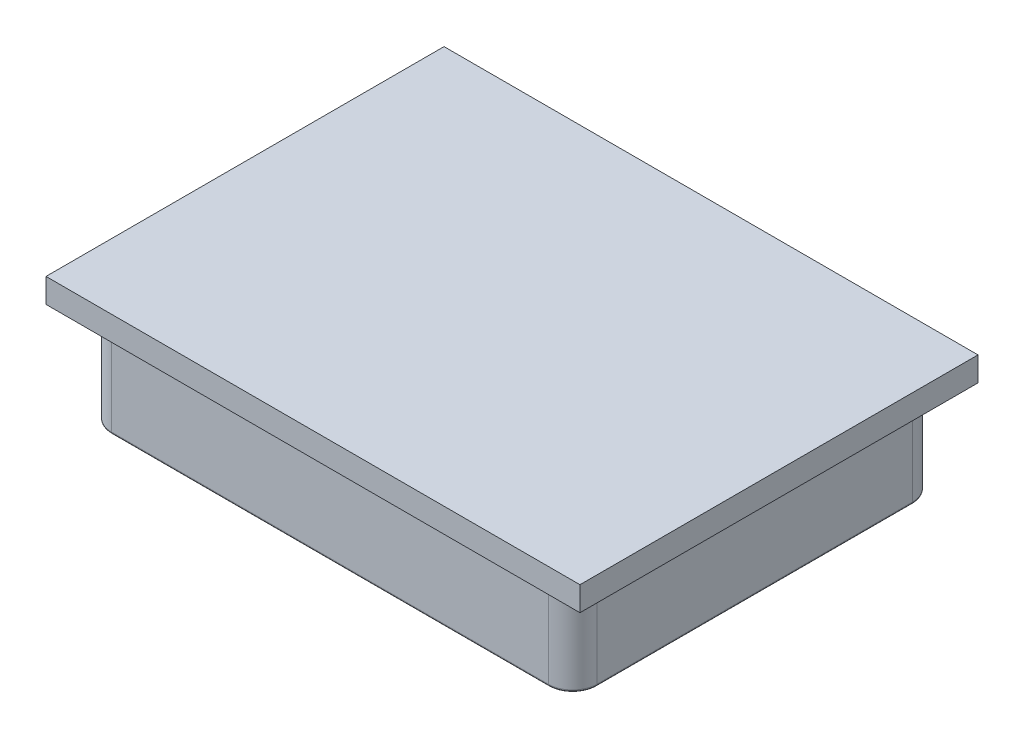
ISO-10303-21;
HEADER;
FILE_DESCRIPTION(('STEP AP214'),'2;1');
FILE_NAME('part.step','',(''),(''),'','','');
FILE_SCHEMA(('AUTOMOTIVE_DESIGN { 1 0 10303 214 1 1 1 1 }'));
ENDSEC;
DATA;
#1=APPLICATION_CONTEXT('core data for automotive mechanical design processes');
#2=APPLICATION_PROTOCOL_DEFINITION('international standard','automotive_design',2000,#1);
#3=PRODUCT_CONTEXT('',#1,'mechanical');
#4=PRODUCT('Part','Part','',(#3));
#5=PRODUCT_RELATED_PRODUCT_CATEGORY('part','',(#4));
#6=PRODUCT_DEFINITION_FORMATION('','',#4);
#7=PRODUCT_DEFINITION_CONTEXT('part definition',#1,'design');
#8=PRODUCT_DEFINITION('design','',#6,#7);
#9=PRODUCT_DEFINITION_SHAPE('','',#8);
#10=(LENGTH_UNIT() NAMED_UNIT(*) SI_UNIT(.MILLI.,.METRE.));
#11=(NAMED_UNIT(*) PLANE_ANGLE_UNIT() SI_UNIT($,.RADIAN.));
#12=(NAMED_UNIT(*) SI_UNIT($,.STERADIAN.) SOLID_ANGLE_UNIT());
#13=UNCERTAINTY_MEASURE_WITH_UNIT(LENGTH_MEASURE(1.E-05),#10,'distance_accuracy_value','');
#14=(GEOMETRIC_REPRESENTATION_CONTEXT(3) GLOBAL_UNCERTAINTY_ASSIGNED_CONTEXT((#13)) GLOBAL_UNIT_ASSIGNED_CONTEXT((#10,
#11,#12)) REPRESENTATION_CONTEXT('',''));
#15=CARTESIAN_POINT('',(0.,0.,0.));
#16=DIRECTION('',(0.,0.,1.));
#17=DIRECTION('',(1.,0.,0.));
#18=AXIS2_PLACEMENT_3D('',#15,#16,#17);
#19=CARTESIAN_POINT('',(0.,25.,0.));
#20=DIRECTION('',(0.,-1.,0.));
#21=DIRECTION('',(0.,0.,-1.));
#22=AXIS2_PLACEMENT_3D('',#19,#20,#21);
#23=PLANE('',#22);
#24=DIRECTION('',(0.,0.,-1.));
#25=VECTOR('',#24,1.);
#26=CARTESIAN_POINT('',(-55.,25.,-41.));
#27=LINE('',#26,#25);
#28=CARTESIAN_POINT('',(-55.,25.,41.));
#29=VERTEX_POINT('',#28);
#30=CARTESIAN_POINT('',(-55.,25.,-41.));
#31=VERTEX_POINT('',#30);
#32=EDGE_CURVE('E318',#29,#31,#27,.T.);
#33=ORIENTED_EDGE('',*,*,#32,.F.);
#34=DIRECTION('',(-1.,0.,0.));
#35=VECTOR('',#34,1.);
#36=CARTESIAN_POINT('',(55.,25.,41.));
#37=LINE('',#36,#35);
#38=CARTESIAN_POINT('',(55.,25.,41.));
#39=VERTEX_POINT('',#38);
#40=EDGE_CURVE('E327',#39,#29,#37,.T.);
#41=ORIENTED_EDGE('',*,*,#40,.F.);
#42=DIRECTION('',(0.,0.,1.));
#43=VECTOR('',#42,1.);
#44=CARTESIAN_POINT('',(55.,25.,-41.));
#45=LINE('',#44,#43);
#46=CARTESIAN_POINT('',(55.,25.,-41.));
#47=VERTEX_POINT('',#46);
#48=EDGE_CURVE('E324',#47,#39,#45,.T.);
#49=ORIENTED_EDGE('',*,*,#48,.F.);
#50=DIRECTION('',(1.,0.,0.));
#51=VECTOR('',#50,1.);
#52=CARTESIAN_POINT('',(55.,25.,-41.));
#53=LINE('',#52,#51);
#54=EDGE_CURVE('E321',#31,#47,#53,.T.);
#55=ORIENTED_EDGE('',*,*,#54,.F.);
#56=EDGE_LOOP('',(#33,#41,#49,#55));
#57=FACE_BOUND('',#56,.T.);
#58=ADVANCED_FACE('F48',(#57),#23,.F.);
#59=CARTESIAN_POINT('',(55.,25.,-41.));
#60=DIRECTION('',(0.,0.,-1.));
#61=DIRECTION('',(-1.,0.,0.));
#62=AXIS2_PLACEMENT_3D('',#59,#60,#61);
#63=PLANE('',#62);
#64=DIRECTION('',(0.,-1.,0.));
#65=VECTOR('',#64,1.);
#66=CARTESIAN_POINT('',(55.,25.,-41.));
#67=LINE('',#66,#65);
#68=CARTESIAN_POINT('',(55.,20.,-41.));
#69=VERTEX_POINT('',#68);
#70=EDGE_CURVE('E337',#47,#69,#67,.T.);
#71=ORIENTED_EDGE('',*,*,#70,.T.);
#72=DIRECTION('',(-1.,0.,0.));
#73=VECTOR('',#72,1.);
#74=CARTESIAN_POINT('',(55.,20.,-41.));
#75=LINE('',#74,#73);
#76=CARTESIAN_POINT('',(-55.,20.,-41.));
#77=VERTEX_POINT('',#76);
#78=EDGE_CURVE('E52',#69,#77,#75,.T.);
#79=ORIENTED_EDGE('',*,*,#78,.T.);
#80=DIRECTION('',(0.,-1.,0.));
#81=VECTOR('',#80,1.);
#82=CARTESIAN_POINT('',(-55.,25.,-41.));
#83=LINE('',#82,#81);
#84=EDGE_CURVE('E330',#31,#77,#83,.T.);
#85=ORIENTED_EDGE('',*,*,#84,.F.);
#86=ORIENTED_EDGE('',*,*,#54,.T.);
#87=EDGE_LOOP('',(#71,#79,#85,#86));
#88=FACE_BOUND('',#87,.T.);
#89=ADVANCED_FACE('F352',(#88),#63,.T.);
#90=CARTESIAN_POINT('',(55.,25.,-41.));
#91=DIRECTION('',(1.,0.,0.));
#92=DIRECTION('',(0.,0.,-1.));
#93=AXIS2_PLACEMENT_3D('',#90,#91,#92);
#94=PLANE('',#93);
#95=DIRECTION('',(0.,-1.,0.));
#96=VECTOR('',#95,1.);
#97=CARTESIAN_POINT('',(55.,25.,41.));
#98=LINE('',#97,#96);
#99=CARTESIAN_POINT('',(55.,20.,41.));
#100=VERTEX_POINT('',#99);
#101=EDGE_CURVE('E334',#39,#100,#98,.T.);
#102=ORIENTED_EDGE('',*,*,#101,.T.);
#103=DIRECTION('',(0.,0.,-1.));
#104=VECTOR('',#103,1.);
#105=CARTESIAN_POINT('',(55.,20.,-41.));
#106=LINE('',#105,#104);
#107=EDGE_CURVE('E230',#100,#69,#106,.T.);
#108=ORIENTED_EDGE('',*,*,#107,.T.);
#109=ORIENTED_EDGE('',*,*,#70,.F.);
#110=ORIENTED_EDGE('',*,*,#48,.T.);
#111=EDGE_LOOP('',(#102,#108,#109,#110));
#112=FACE_BOUND('',#111,.T.);
#113=ADVANCED_FACE('F358',(#112),#94,.T.);
#114=CARTESIAN_POINT('',(55.,25.,41.));
#115=DIRECTION('',(0.,0.,1.));
#116=DIRECTION('',(1.,0.,0.));
#117=AXIS2_PLACEMENT_3D('',#114,#115,#116);
#118=PLANE('',#117);
#119=DIRECTION('',(0.,-1.,0.));
#120=VECTOR('',#119,1.);
#121=CARTESIAN_POINT('',(-55.,25.,41.));
#122=LINE('',#121,#120);
#123=CARTESIAN_POINT('',(-55.,20.,41.));
#124=VERTEX_POINT('',#123);
#125=EDGE_CURVE('E331',#29,#124,#122,.T.);
#126=ORIENTED_EDGE('',*,*,#125,.T.);
#127=DIRECTION('',(1.,0.,0.));
#128=VECTOR('',#127,1.);
#129=CARTESIAN_POINT('',(55.,20.,41.));
#130=LINE('',#129,#128);
#131=EDGE_CURVE('E312',#124,#100,#130,.T.);
#132=ORIENTED_EDGE('',*,*,#131,.T.);
#133=ORIENTED_EDGE('',*,*,#101,.F.);
#134=ORIENTED_EDGE('',*,*,#40,.T.);
#135=EDGE_LOOP('',(#126,#132,#133,#134));
#136=FACE_BOUND('',#135,.T.);
#137=ADVANCED_FACE('F365',(#136),#118,.T.);
#138=CARTESIAN_POINT('',(-55.,25.,-41.));
#139=DIRECTION('',(-1.,0.,0.));
#140=DIRECTION('',(0.,0.,1.));
#141=AXIS2_PLACEMENT_3D('',#138,#139,#140);
#142=PLANE('',#141);
#143=ORIENTED_EDGE('',*,*,#84,.T.);
#144=DIRECTION('',(0.,0.,1.));
#145=VECTOR('',#144,1.);
#146=CARTESIAN_POINT('',(-55.,20.,-41.));
#147=LINE('',#146,#145);
#148=EDGE_CURVE('E315',#77,#124,#147,.T.);
#149=ORIENTED_EDGE('',*,*,#148,.T.);
#150=ORIENTED_EDGE('',*,*,#125,.F.);
#151=ORIENTED_EDGE('',*,*,#32,.T.);
#152=EDGE_LOOP('',(#143,#149,#150,#151));
#153=FACE_BOUND('',#152,.T.);
#154=ADVANCED_FACE('F50',(#153),#142,.T.);
#155=CARTESIAN_POINT('',(-50.,0.5,37.));
#156=DIRECTION('',(-1.,0.,0.));
#157=DIRECTION('',(0.,0.,1.));
#158=AXIS2_PLACEMENT_3D('',#155,#156,#157);
#159=CYLINDRICAL_SURFACE('',#158,0.5);
#160=CARTESIAN_POINT('',(-45.,0.5,37.));
#161=DIRECTION('',(1.,0.,0.));
#162=DIRECTION('',(0.,0.,-1.));
#163=AXIS2_PLACEMENT_3D('',#160,#161,#162);
#164=CIRCLE('',#163,0.5);
#165=CARTESIAN_POINT('',(-45.,0.5,37.5));
#166=VERTEX_POINT('',#165);
#167=CARTESIAN_POINT('',(-45.,0.,37.));
#168=VERTEX_POINT('',#167);
#169=EDGE_CURVE('E223',#166,#168,#164,.T.);
#170=ORIENTED_EDGE('',*,*,#169,.T.);
#171=DIRECTION('',(1.,0.,0.));
#172=VECTOR('',#171,1.);
#173=CARTESIAN_POINT('',(-45.,0.,37.));
#174=LINE('',#173,#172);
#175=CARTESIAN_POINT('',(45.,0.,37.));
#176=VERTEX_POINT('',#175);
#177=EDGE_CURVE('E250',#176,#168,#174,.F.);
#178=ORIENTED_EDGE('',*,*,#177,.F.);
#179=CARTESIAN_POINT('',(45.,0.5,37.));
#180=DIRECTION('',(1.,0.,0.));
#181=DIRECTION('',(0.,0.,-1.));
#182=AXIS2_PLACEMENT_3D('',#179,#180,#181);
#183=CIRCLE('',#182,0.5);
#184=CARTESIAN_POINT('',(45.,0.5,37.5));
#185=VERTEX_POINT('',#184);
#186=EDGE_CURVE('E222',#185,#176,#183,.T.);
#187=ORIENTED_EDGE('',*,*,#186,.F.);
#188=DIRECTION('',(1.,0.,0.));
#189=VECTOR('',#188,1.);
#190=CARTESIAN_POINT('',(45.,0.5,37.5));
#191=LINE('',#190,#189);
#192=EDGE_CURVE('E219',#166,#185,#191,.T.);
#193=ORIENTED_EDGE('',*,*,#192,.F.);
#194=EDGE_LOOP('',(#170,#178,#187,#193));
#195=FACE_BOUND('',#194,.T.);
#196=ADVANCED_FACE('F404',(#195),#159,.T.);
#197=CARTESIAN_POINT('',(45.,0.5,32.5));
#198=DIRECTION('',(0.,-1.,0.));
#199=DIRECTION('',(0.,0.,-1.));
#200=AXIS2_PLACEMENT_3D('',#197,#198,#199);
#201=TOROIDAL_SURFACE('',#200,4.5,0.5);
#202=CARTESIAN_POINT('',(49.5,0.5,32.5));
#203=DIRECTION('',(0.,0.,1.));
#204=DIRECTION('',(1.,0.,0.));
#205=AXIS2_PLACEMENT_3D('',#202,#203,#204);
#206=CIRCLE('',#205,0.5);
#207=CARTESIAN_POINT('',(49.5,0.,32.5));
#208=VERTEX_POINT('',#207);
#209=CARTESIAN_POINT('',(50.,0.5,32.5));
#210=VERTEX_POINT('',#209);
#211=EDGE_CURVE('E253',#208,#210,#206,.T.);
#212=ORIENTED_EDGE('',*,*,#211,.T.);
#213=CARTESIAN_POINT('',(45.,0.5,32.5));
#214=DIRECTION('',(0.,-1.,0.));
#215=DIRECTION('',(0.,0.,-1.));
#216=AXIS2_PLACEMENT_3D('',#213,#214,#215);
#217=CIRCLE('',#216,5.);
#218=EDGE_CURVE('E212',#185,#210,#217,.F.);
#219=ORIENTED_EDGE('',*,*,#218,.F.);
#220=ORIENTED_EDGE('',*,*,#186,.T.);
#221=CARTESIAN_POINT('',(45.,0.,32.5));
#222=DIRECTION('',(0.,-1.,0.));
#223=DIRECTION('',(0.,0.,-1.));
#224=AXIS2_PLACEMENT_3D('',#221,#222,#223);
#225=CIRCLE('',#224,4.5);
#226=EDGE_CURVE('E216',#208,#176,#225,.T.);
#227=ORIENTED_EDGE('',*,*,#226,.F.);
#228=EDGE_LOOP('',(#212,#219,#220,#227));
#229=FACE_BOUND('',#228,.T.);
#230=ADVANCED_FACE('F390',(#229),#201,.T.);
#231=CARTESIAN_POINT('',(-50.,0.5,-37.));
#232=DIRECTION('',(1.,0.,0.));
#233=DIRECTION('',(0.,0.,-1.));
#234=AXIS2_PLACEMENT_3D('',#231,#232,#233);
#235=CYLINDRICAL_SURFACE('',#234,0.5);
#236=CARTESIAN_POINT('',(-45.,0.5,-37.));
#237=DIRECTION('',(1.,0.,0.));
#238=DIRECTION('',(0.,0.,-1.));
#239=AXIS2_PLACEMENT_3D('',#236,#237,#238);
#240=CIRCLE('',#239,0.5);
#241=CARTESIAN_POINT('',(-45.,0.,-37.));
#242=VERTEX_POINT('',#241);
#243=CARTESIAN_POINT('',(-45.,0.5,-37.5));
#244=VERTEX_POINT('',#243);
#245=EDGE_CURVE('E215',#242,#244,#240,.T.);
#246=ORIENTED_EDGE('',*,*,#245,.T.);
#247=DIRECTION('',(-1.,0.,0.));
#248=VECTOR('',#247,1.);
#249=CARTESIAN_POINT('',(-45.,0.5,-37.5));
#250=LINE('',#249,#248);
#251=CARTESIAN_POINT('',(45.,0.5,-37.5));
#252=VERTEX_POINT('',#251);
#253=EDGE_CURVE('E187',#252,#244,#250,.T.);
#254=ORIENTED_EDGE('',*,*,#253,.F.);
#255=CARTESIAN_POINT('',(45.,0.5,-37.));
#256=DIRECTION('',(1.,0.,0.));
#257=DIRECTION('',(0.,0.,-1.));
#258=AXIS2_PLACEMENT_3D('',#255,#256,#257);
#259=CIRCLE('',#258,0.5);
#260=CARTESIAN_POINT('',(45.,0.,-37.));
#261=VERTEX_POINT('',#260);
#262=EDGE_CURVE('E191',#261,#252,#259,.T.);
#263=ORIENTED_EDGE('',*,*,#262,.F.);
#264=DIRECTION('',(-1.,0.,0.));
#265=VECTOR('',#264,1.);
#266=CARTESIAN_POINT('',(45.,0.,-37.));
#267=LINE('',#266,#265);
#268=EDGE_CURVE('E243',#242,#261,#267,.F.);
#269=ORIENTED_EDGE('',*,*,#268,.F.);
#270=EDGE_LOOP('',(#246,#254,#263,#269));
#271=FACE_BOUND('',#270,.T.);
#272=ADVANCED_FACE('F420',(#271),#235,.T.);
#273=CARTESIAN_POINT('',(45.,0.5,-32.5));
#274=DIRECTION('',(0.,-1.,0.));
#275=DIRECTION('',(0.,0.,-1.));
#276=AXIS2_PLACEMENT_3D('',#273,#274,#275);
#277=TOROIDAL_SURFACE('',#276,4.5,0.5);
#278=ORIENTED_EDGE('',*,*,#262,.T.);
#279=CARTESIAN_POINT('',(45.,0.5,-32.5));
#280=DIRECTION('',(0.,-1.,0.));
#281=DIRECTION('',(0.,0.,-1.));
#282=AXIS2_PLACEMENT_3D('',#279,#280,#281);
#283=CIRCLE('',#282,5.);
#284=CARTESIAN_POINT('',(50.,0.5,-32.5));
#285=VERTEX_POINT('',#284);
#286=EDGE_CURVE('E196',#285,#252,#283,.F.);
#287=ORIENTED_EDGE('',*,*,#286,.F.);
#288=CARTESIAN_POINT('',(49.5,0.5,-32.5));
#289=DIRECTION('',(0.,0.,1.));
#290=DIRECTION('',(1.,0.,0.));
#291=AXIS2_PLACEMENT_3D('',#288,#289,#290);
#292=CIRCLE('',#291,0.5);
#293=CARTESIAN_POINT('',(49.5,0.,-32.5));
#294=VERTEX_POINT('',#293);
#295=EDGE_CURVE('E200',#294,#285,#292,.T.);
#296=ORIENTED_EDGE('',*,*,#295,.F.);
#297=CARTESIAN_POINT('',(45.,0.,-32.5));
#298=DIRECTION('',(0.,-1.,0.));
#299=DIRECTION('',(0.,0.,-1.));
#300=AXIS2_PLACEMENT_3D('',#297,#298,#299);
#301=CIRCLE('',#300,4.5);
#302=EDGE_CURVE('E190',#261,#294,#301,.T.);
#303=ORIENTED_EDGE('',*,*,#302,.F.);
#304=EDGE_LOOP('',(#278,#287,#296,#303));
#305=FACE_BOUND('',#304,.T.);
#306=ADVANCED_FACE('F423',(#305),#277,.T.);
#307=CARTESIAN_POINT('',(49.5,0.5,37.5));
#308=DIRECTION('',(0.,0.,1.));
#309=DIRECTION('',(1.,0.,0.));
#310=AXIS2_PLACEMENT_3D('',#307,#308,#309);
#311=CYLINDRICAL_SURFACE('',#310,0.5);
#312=ORIENTED_EDGE('',*,*,#295,.T.);
#313=DIRECTION('',(0.,0.,-1.));
#314=VECTOR('',#313,1.);
#315=CARTESIAN_POINT('',(50.,0.5,-32.5));
#316=LINE('',#315,#314);
#317=EDGE_CURVE('E204',#210,#285,#316,.T.);
#318=ORIENTED_EDGE('',*,*,#317,.F.);
#319=ORIENTED_EDGE('',*,*,#211,.F.);
#320=DIRECTION('',(0.,0.,-1.));
#321=VECTOR('',#320,1.);
#322=CARTESIAN_POINT('',(49.5,0.,32.5));
#323=LINE('',#322,#321);
#324=EDGE_CURVE('E199',#294,#208,#323,.F.);
#325=ORIENTED_EDGE('',*,*,#324,.F.);
#326=EDGE_LOOP('',(#312,#318,#319,#325));
#327=FACE_BOUND('',#326,.T.);
#328=ADVANCED_FACE('F394',(#327),#311,.T.);
#329=CARTESIAN_POINT('',(0.,0.,0.));
#330=DIRECTION('',(0.,-1.,0.));
#331=DIRECTION('',(0.,0.,-1.));
#332=AXIS2_PLACEMENT_3D('',#329,#330,#331);
#333=PLANE('',#332);
#334=ORIENTED_EDGE('',*,*,#324,.T.);
#335=ORIENTED_EDGE('',*,*,#226,.T.);
#336=ORIENTED_EDGE('',*,*,#177,.T.);
#337=CARTESIAN_POINT('',(-45.,0.,32.5));
#338=DIRECTION('',(0.,-1.,0.));
#339=DIRECTION('',(0.,0.,-1.));
#340=AXIS2_PLACEMENT_3D('',#337,#338,#339);
#341=CIRCLE('',#340,4.5);
#342=CARTESIAN_POINT('',(-49.5,0.,32.5));
#343=VERTEX_POINT('',#342);
#344=EDGE_CURVE('E231',#168,#343,#341,.T.);
#345=ORIENTED_EDGE('',*,*,#344,.T.);
#346=DIRECTION('',(0.,0.,1.));
#347=VECTOR('',#346,1.);
#348=CARTESIAN_POINT('',(-49.5,0.,-32.5));
#349=LINE('',#348,#347);
#350=CARTESIAN_POINT('',(-49.5,0.,-32.5));
#351=VERTEX_POINT('',#350);
#352=EDGE_CURVE('E234',#343,#351,#349,.F.);
#353=ORIENTED_EDGE('',*,*,#352,.T.);
#354=CARTESIAN_POINT('',(-45.,0.,-32.5));
#355=DIRECTION('',(0.,-1.,0.));
#356=DIRECTION('',(0.,0.,-1.));
#357=AXIS2_PLACEMENT_3D('',#354,#355,#356);
#358=CIRCLE('',#357,4.5);
#359=EDGE_CURVE('E207',#351,#242,#358,.T.);
#360=ORIENTED_EDGE('',*,*,#359,.T.);
#361=ORIENTED_EDGE('',*,*,#268,.T.);
#362=ORIENTED_EDGE('',*,*,#302,.T.);
#363=EDGE_LOOP('',(#334,#335,#336,#345,#353,#360,#361,#362));
#364=FACE_BOUND('',#363,.T.);
#365=ADVANCED_FACE('F385',(#364),#333,.T.);
#366=CARTESIAN_POINT('',(-45.,0.5,-32.5));
#367=DIRECTION('',(0.,-1.,0.));
#368=DIRECTION('',(0.,0.,-1.));
#369=AXIS2_PLACEMENT_3D('',#366,#367,#368);
#370=TOROIDAL_SURFACE('',#369,4.5,0.5);
#371=CARTESIAN_POINT('',(-49.5,0.5,-32.5));
#372=DIRECTION('',(0.,0.,1.));
#373=DIRECTION('',(1.,0.,0.));
#374=AXIS2_PLACEMENT_3D('',#371,#372,#373);
#375=CIRCLE('',#374,0.5);
#376=CARTESIAN_POINT('',(-50.,0.5,-32.5));
#377=VERTEX_POINT('',#376);
#378=EDGE_CURVE('E183',#377,#351,#375,.T.);
#379=ORIENTED_EDGE('',*,*,#378,.F.);
#380=CARTESIAN_POINT('',(-45.,0.5,-32.5));
#381=DIRECTION('',(0.,-1.,0.));
#382=DIRECTION('',(0.,0.,-1.));
#383=AXIS2_PLACEMENT_3D('',#380,#381,#382);
#384=CIRCLE('',#383,5.);
#385=EDGE_CURVE('E169',#244,#377,#384,.F.);
#386=ORIENTED_EDGE('',*,*,#385,.F.);
#387=ORIENTED_EDGE('',*,*,#245,.F.);
#388=ORIENTED_EDGE('',*,*,#359,.F.);
#389=EDGE_LOOP('',(#379,#386,#387,#388));
#390=FACE_BOUND('',#389,.T.);
#391=ADVANCED_FACE('F414',(#390),#370,.T.);
#392=CARTESIAN_POINT('',(-49.5,0.5,37.5));
#393=DIRECTION('',(0.,0.,-1.));
#394=DIRECTION('',(-1.,0.,0.));
#395=AXIS2_PLACEMENT_3D('',#392,#393,#394);
#396=CYLINDRICAL_SURFACE('',#395,0.5);
#397=ORIENTED_EDGE('',*,*,#378,.T.);
#398=ORIENTED_EDGE('',*,*,#352,.F.);
#399=CARTESIAN_POINT('',(-49.5,0.5,32.5));
#400=DIRECTION('',(0.,0.,1.));
#401=DIRECTION('',(1.,0.,0.));
#402=AXIS2_PLACEMENT_3D('',#399,#400,#401);
#403=CIRCLE('',#402,0.5);
#404=CARTESIAN_POINT('',(-50.,0.5,32.5));
#405=VERTEX_POINT('',#404);
#406=EDGE_CURVE('E180',#405,#343,#403,.T.);
#407=ORIENTED_EDGE('',*,*,#406,.F.);
#408=DIRECTION('',(0.,0.,1.));
#409=VECTOR('',#408,1.);
#410=CARTESIAN_POINT('',(-50.,0.5,32.5));
#411=LINE('',#410,#409);
#412=EDGE_CURVE('E178',#377,#405,#411,.T.);
#413=ORIENTED_EDGE('',*,*,#412,.F.);
#414=EDGE_LOOP('',(#397,#398,#407,#413));
#415=FACE_BOUND('',#414,.T.);
#416=ADVANCED_FACE('F412',(#415),#396,.T.);
#417=CARTESIAN_POINT('',(-45.,0.5,32.5));
#418=DIRECTION('',(0.,-1.,0.));
#419=DIRECTION('',(0.,0.,-1.));
#420=AXIS2_PLACEMENT_3D('',#417,#418,#419);
#421=TOROIDAL_SURFACE('',#420,4.5,0.5);
#422=ORIENTED_EDGE('',*,*,#406,.T.);
#423=ORIENTED_EDGE('',*,*,#344,.F.);
#424=ORIENTED_EDGE('',*,*,#169,.F.);
#425=CARTESIAN_POINT('',(-45.,0.5,32.5));
#426=DIRECTION('',(0.,-1.,0.));
#427=DIRECTION('',(0.,0.,-1.));
#428=AXIS2_PLACEMENT_3D('',#425,#426,#427);
#429=CIRCLE('',#428,5.);
#430=EDGE_CURVE('E177',#405,#166,#429,.F.);
#431=ORIENTED_EDGE('',*,*,#430,.F.);
#432=EDGE_LOOP('',(#422,#423,#424,#431));
#433=FACE_BOUND('',#432,.T.);
#434=ADVANCED_FACE('F438',(#433),#421,.T.);
#435=CARTESIAN_POINT('',(-45.,20.,32.5));
#436=DIRECTION('',(0.,-1.,0.));
#437=DIRECTION('',(0.,0.,-1.));
#438=AXIS2_PLACEMENT_3D('',#435,#436,#437);
#439=CYLINDRICAL_SURFACE('',#438,5.);
#440=DIRECTION('',(0.,-1.,0.));
#441=VECTOR('',#440,1.);
#442=CARTESIAN_POINT('',(-50.,20.,32.5));
#443=LINE('',#442,#441);
#444=CARTESIAN_POINT('',(-50.,20.,32.5));
#445=VERTEX_POINT('',#444);
#446=EDGE_CURVE('E155',#405,#445,#443,.F.);
#447=ORIENTED_EDGE('',*,*,#446,.F.);
#448=ORIENTED_EDGE('',*,*,#430,.T.);
#449=DIRECTION('',(0.,-1.,0.));
#450=VECTOR('',#449,1.);
#451=CARTESIAN_POINT('',(-45.,20.,37.5));
#452=LINE('',#451,#450);
#453=CARTESIAN_POINT('',(-45.,20.,37.5));
#454=VERTEX_POINT('',#453);
#455=EDGE_CURVE('E217',#454,#166,#452,.T.);
#456=ORIENTED_EDGE('',*,*,#455,.F.);
#457=CARTESIAN_POINT('',(-45.,20.,32.5));
#458=DIRECTION('',(0.,-1.,0.));
#459=DIRECTION('',(0.,0.,-1.));
#460=AXIS2_PLACEMENT_3D('',#457,#458,#459);
#461=CIRCLE('',#460,5.);
#462=EDGE_CURVE('E174',#445,#454,#461,.F.);
#463=ORIENTED_EDGE('',*,*,#462,.F.);
#464=EDGE_LOOP('',(#447,#448,#456,#463));
#465=FACE_BOUND('',#464,.T.);
#466=ADVANCED_FACE('F436',(#465),#439,.T.);
#467=CARTESIAN_POINT('',(-50.,20.,37.5));
#468=DIRECTION('',(0.,0.,-1.));
#469=DIRECTION('',(-1.,0.,0.));
#470=AXIS2_PLACEMENT_3D('',#467,#468,#469);
#471=PLANE('',#470);
#472=ORIENTED_EDGE('',*,*,#455,.T.);
#473=ORIENTED_EDGE('',*,*,#192,.T.);
#474=DIRECTION('',(0.,-1.,0.));
#475=VECTOR('',#474,1.);
#476=CARTESIAN_POINT('',(45.,20.,37.5));
#477=LINE('',#476,#475);
#478=CARTESIAN_POINT('',(45.,20.,37.5));
#479=VERTEX_POINT('',#478);
#480=EDGE_CURVE('E208',#185,#479,#477,.F.);
#481=ORIENTED_EDGE('',*,*,#480,.T.);
#482=DIRECTION('',(1.,0.,0.));
#483=VECTOR('',#482,1.);
#484=CARTESIAN_POINT('',(-50.,20.,37.5));
#485=LINE('',#484,#483);
#486=EDGE_CURVE('E211',#454,#479,#485,.T.);
#487=ORIENTED_EDGE('',*,*,#486,.F.);
#488=EDGE_LOOP('',(#472,#473,#481,#487));
#489=FACE_BOUND('',#488,.T.);
#490=ADVANCED_FACE('F401',(#489),#471,.F.);
#491=CARTESIAN_POINT('',(45.,20.,32.5));
#492=DIRECTION('',(0.,-1.,0.));
#493=DIRECTION('',(0.,0.,-1.));
#494=AXIS2_PLACEMENT_3D('',#491,#492,#493);
#495=CYLINDRICAL_SURFACE('',#494,5.);
#496=ORIENTED_EDGE('',*,*,#480,.F.);
#497=ORIENTED_EDGE('',*,*,#218,.T.);
#498=DIRECTION('',(0.,-1.,0.));
#499=VECTOR('',#498,1.);
#500=CARTESIAN_POINT('',(50.,20.,32.5));
#501=LINE('',#500,#499);
#502=CARTESIAN_POINT('',(50.,20.,32.5));
#503=VERTEX_POINT('',#502);
#504=EDGE_CURVE('E201',#503,#210,#501,.T.);
#505=ORIENTED_EDGE('',*,*,#504,.F.);
#506=CARTESIAN_POINT('',(45.,20.,32.5));
#507=DIRECTION('',(0.,-1.,0.));
#508=DIRECTION('',(0.,0.,-1.));
#509=AXIS2_PLACEMENT_3D('',#506,#507,#508);
#510=CIRCLE('',#509,5.);
#511=EDGE_CURVE('E203',#479,#503,#510,.F.);
#512=ORIENTED_EDGE('',*,*,#511,.F.);
#513=EDGE_LOOP('',(#496,#497,#505,#512));
#514=FACE_BOUND('',#513,.T.);
#515=ADVANCED_FACE('F398',(#514),#495,.T.);
#516=CARTESIAN_POINT('',(50.,20.,37.5));
#517=DIRECTION('',(-1.,0.,0.));
#518=DIRECTION('',(0.,0.,1.));
#519=AXIS2_PLACEMENT_3D('',#516,#517,#518);
#520=PLANE('',#519);
#521=ORIENTED_EDGE('',*,*,#504,.T.);
#522=ORIENTED_EDGE('',*,*,#317,.T.);
#523=DIRECTION('',(0.,-1.,0.));
#524=VECTOR('',#523,1.);
#525=CARTESIAN_POINT('',(50.,20.,-32.5));
#526=LINE('',#525,#524);
#527=CARTESIAN_POINT('',(50.,20.,-32.5));
#528=VERTEX_POINT('',#527);
#529=EDGE_CURVE('E192',#285,#528,#526,.F.);
#530=ORIENTED_EDGE('',*,*,#529,.T.);
#531=DIRECTION('',(0.,0.,-1.));
#532=VECTOR('',#531,1.);
#533=CARTESIAN_POINT('',(50.,20.,37.5));
#534=LINE('',#533,#532);
#535=EDGE_CURVE('E195',#503,#528,#534,.T.);
#536=ORIENTED_EDGE('',*,*,#535,.F.);
#537=EDGE_LOOP('',(#521,#522,#530,#536));
#538=FACE_BOUND('',#537,.T.);
#539=ADVANCED_FACE('F428',(#538),#520,.F.);
#540=CARTESIAN_POINT('',(45.,20.,-32.5));
#541=DIRECTION('',(0.,-1.,0.));
#542=DIRECTION('',(0.,0.,-1.));
#543=AXIS2_PLACEMENT_3D('',#540,#541,#542);
#544=CYLINDRICAL_SURFACE('',#543,5.);
#545=ORIENTED_EDGE('',*,*,#529,.F.);
#546=ORIENTED_EDGE('',*,*,#286,.T.);
#547=DIRECTION('',(0.,-1.,0.));
#548=VECTOR('',#547,1.);
#549=CARTESIAN_POINT('',(45.,20.,-37.5));
#550=LINE('',#549,#548);
#551=CARTESIAN_POINT('',(45.,20.,-37.5));
#552=VERTEX_POINT('',#551);
#553=EDGE_CURVE('E184',#552,#252,#550,.T.);
#554=ORIENTED_EDGE('',*,*,#553,.F.);
#555=CARTESIAN_POINT('',(45.,20.,-32.5));
#556=DIRECTION('',(0.,-1.,0.));
#557=DIRECTION('',(0.,0.,-1.));
#558=AXIS2_PLACEMENT_3D('',#555,#556,#557);
#559=CIRCLE('',#558,5.);
#560=EDGE_CURVE('E186',#528,#552,#559,.F.);
#561=ORIENTED_EDGE('',*,*,#560,.F.);
#562=EDGE_LOOP('',(#545,#546,#554,#561));
#563=FACE_BOUND('',#562,.T.);
#564=ADVANCED_FACE('F426',(#563),#544,.T.);
#565=CARTESIAN_POINT('',(-50.,20.,-37.5));
#566=DIRECTION('',(0.,0.,1.));
#567=DIRECTION('',(1.,0.,0.));
#568=AXIS2_PLACEMENT_3D('',#565,#566,#567);
#569=PLANE('',#568);
#570=ORIENTED_EDGE('',*,*,#553,.T.);
#571=ORIENTED_EDGE('',*,*,#253,.T.);
#572=DIRECTION('',(0.,-1.,0.));
#573=VECTOR('',#572,1.);
#574=CARTESIAN_POINT('',(-45.,20.,-37.5));
#575=LINE('',#574,#573);
#576=CARTESIAN_POINT('',(-45.,20.,-37.5));
#577=VERTEX_POINT('',#576);
#578=EDGE_CURVE('E164',#244,#577,#575,.F.);
#579=ORIENTED_EDGE('',*,*,#578,.T.);
#580=DIRECTION('',(-1.,0.,0.));
#581=VECTOR('',#580,1.);
#582=CARTESIAN_POINT('',(-50.,20.,-37.5));
#583=LINE('',#582,#581);
#584=EDGE_CURVE('E162',#552,#577,#583,.T.);
#585=ORIENTED_EDGE('',*,*,#584,.F.);
#586=EDGE_LOOP('',(#570,#571,#579,#585));
#587=FACE_BOUND('',#586,.T.);
#588=ADVANCED_FACE('F579',(#587),#569,.F.);
#589=CARTESIAN_POINT('',(-45.,20.,-32.5));
#590=DIRECTION('',(0.,-1.,0.));
#591=DIRECTION('',(0.,0.,-1.));
#592=AXIS2_PLACEMENT_3D('',#589,#590,#591);
#593=CYLINDRICAL_SURFACE('',#592,5.);
#594=ORIENTED_EDGE('',*,*,#578,.F.);
#595=ORIENTED_EDGE('',*,*,#385,.T.);
#596=DIRECTION('',(0.,-1.,0.));
#597=VECTOR('',#596,1.);
#598=CARTESIAN_POINT('',(-50.,20.,-32.5));
#599=LINE('',#598,#597);
#600=CARTESIAN_POINT('',(-50.,20.,-32.5));
#601=VERTEX_POINT('',#600);
#602=EDGE_CURVE('E152',#601,#377,#599,.T.);
#603=ORIENTED_EDGE('',*,*,#602,.F.);
#604=CARTESIAN_POINT('',(-45.,20.,-32.5));
#605=DIRECTION('',(0.,-1.,0.));
#606=DIRECTION('',(0.,0.,-1.));
#607=AXIS2_PLACEMENT_3D('',#604,#605,#606);
#608=CIRCLE('',#607,5.);
#609=EDGE_CURVE('E143',#577,#601,#608,.F.);
#610=ORIENTED_EDGE('',*,*,#609,.F.);
#611=EDGE_LOOP('',(#594,#595,#603,#610));
#612=FACE_BOUND('',#611,.T.);
#613=ADVANCED_FACE('F167',(#612),#593,.T.);
#614=CARTESIAN_POINT('',(-50.,20.,37.5));
#615=DIRECTION('',(1.,0.,0.));
#616=DIRECTION('',(0.,0.,-1.));
#617=AXIS2_PLACEMENT_3D('',#614,#615,#616);
#618=PLANE('',#617);
#619=ORIENTED_EDGE('',*,*,#602,.T.);
#620=ORIENTED_EDGE('',*,*,#412,.T.);
#621=ORIENTED_EDGE('',*,*,#446,.T.);
#622=DIRECTION('',(0.,0.,1.));
#623=VECTOR('',#622,1.);
#624=CARTESIAN_POINT('',(-50.,20.,37.5));
#625=LINE('',#624,#623);
#626=EDGE_CURVE('E149',#601,#445,#625,.T.);
#627=ORIENTED_EDGE('',*,*,#626,.F.);
#628=EDGE_LOOP('',(#619,#620,#621,#627));
#629=FACE_BOUND('',#628,.T.);
#630=ADVANCED_FACE('F150',(#629),#618,.F.);
#631=CARTESIAN_POINT('',(0.,20.,0.));
#632=DIRECTION('',(0.,-1.,0.));
#633=DIRECTION('',(0.,0.,-1.));
#634=AXIS2_PLACEMENT_3D('',#631,#632,#633);
#635=PLANE('',#634);
#636=ORIENTED_EDGE('',*,*,#626,.T.);
#637=ORIENTED_EDGE('',*,*,#462,.T.);
#638=ORIENTED_EDGE('',*,*,#486,.T.);
#639=ORIENTED_EDGE('',*,*,#511,.T.);
#640=ORIENTED_EDGE('',*,*,#535,.T.);
#641=ORIENTED_EDGE('',*,*,#560,.T.);
#642=ORIENTED_EDGE('',*,*,#584,.T.);
#643=ORIENTED_EDGE('',*,*,#609,.T.);
#644=EDGE_LOOP('',(#636,#637,#638,#639,#640,#641,#642,#643));
#645=FACE_BOUND('',#644,.T.);
#646=DIRECTION('',(0.,0.,1.));
#647=VECTOR('',#646,1.);
#648=CARTESIAN_POINT('',(-52.,20.,0.));
#649=LINE('',#648,#647);
#650=CARTESIAN_POINT('',(-52.,20.,-32.5));
#651=VERTEX_POINT('',#650);
#652=CARTESIAN_POINT('',(-52.,20.,32.5));
#653=VERTEX_POINT('',#652);
#654=EDGE_CURVE('E68',#651,#653,#649,.T.);
#655=ORIENTED_EDGE('',*,*,#654,.F.);
#656=CARTESIAN_POINT('',(-45.,20.,-39.5));
#657=CARTESIAN_POINT('',(-45.6891810343366,20.,-39.5));
#658=CARTESIAN_POINT('',(-46.3656322541129,20.,-39.3654969628226));
#659=CARTESIAN_POINT('',(-47.0413319485692,20.,-39.2311433561364));
#660=CARTESIAN_POINT('',(-47.6787840265556,20.,-38.967156727579));
#661=CARTESIAN_POINT('',(-48.3152892524453,20.,-38.7035622168001));
#662=CARTESIAN_POINT('',(-48.8889916311372,20.,-38.3202872861178));
#663=CARTESIAN_POINT('',(-49.4618418495963,20.,-37.937581660473));
#664=CARTESIAN_POINT('',(-49.9497474683058,20.,-37.4497474683058));
#665=CARTESIAN_POINT('',(-50.4369283667048,20.,-36.9626378903545));
#666=CARTESIAN_POINT('',(-50.8202872861178,20.,-36.3889916311372));
#667=CARTESIAN_POINT('',(-51.2030767757374,20.,-35.8161974487971));
#668=CARTESIAN_POINT('',(-51.467156727579,20.,-35.1787840265556));
#669=CARTESIAN_POINT('',(-51.7308444230134,20.,-34.5423173990148));
#670=CARTESIAN_POINT('',(-51.8654969628226,20.,-33.8656322541129));
#671=CARTESIAN_POINT('',(-52.,20.,-33.189698422259));
#672=CARTESIAN_POINT('',(-52.,20.,-32.5));
#673=B_SPLINE_CURVE_WITH_KNOTS('',2,(#656,#657,#658,#659,#660,#661,#662,#663,#664,#665,#666,
#667,#668,#669,#670,#671,#672),.UNSPECIFIED.,.F.,.F.,(3,2,2,2,2,2,2,2,3),(0.,0.125,0.25,0.375,
0.5,0.625,0.75,0.875,1.),.UNSPECIFIED.);
#674=CARTESIAN_POINT('',(-45.,20.,-39.5));
#675=VERTEX_POINT('',#674);
#676=EDGE_CURVE('E13',#675,#651,#673,.T.);
#677=ORIENTED_EDGE('',*,*,#676,.F.);
#678=DIRECTION('',(-1.,0.,0.));
#679=VECTOR('',#678,1.);
#680=CARTESIAN_POINT('',(0.,20.,-39.5));
#681=LINE('',#680,#679);
#682=CARTESIAN_POINT('',(45.,20.,-39.5));
#683=VERTEX_POINT('',#682);
#684=EDGE_CURVE('E59',#683,#675,#681,.T.);
#685=ORIENTED_EDGE('',*,*,#684,.F.);
#686=CARTESIAN_POINT('',(52.,20.,-32.5));
#687=CARTESIAN_POINT('',(52.,20.,-33.1891810343179));
#688=CARTESIAN_POINT('',(51.8654969628226,20.,-33.8656322541129));
#689=CARTESIAN_POINT('',(51.7311433561482,20.,-34.5413319485288));
#690=CARTESIAN_POINT('',(51.467156727579,20.,-35.1787840265556));
#691=CARTESIAN_POINT('',(51.2035622168184,20.,-35.8152892524133));
#692=CARTESIAN_POINT('',(50.8202872861178,20.,-36.3889916311372));
#693=CARTESIAN_POINT('',(50.4375816604824,20.,-36.9618418495868));
#694=CARTESIAN_POINT('',(49.9497474683058,20.,-37.4497474683058));
#695=CARTESIAN_POINT('',(49.4626378903544,20.,-37.9369283667049));
#696=CARTESIAN_POINT('',(48.8889916311372,20.,-38.3202872861178));
#697=CARTESIAN_POINT('',(48.3161974487926,20.,-38.7030767757404));
#698=CARTESIAN_POINT('',(47.6787840265556,20.,-38.967156727579));
#699=CARTESIAN_POINT('',(47.0423173990139,20.,-39.2308444230126));
#700=CARTESIAN_POINT('',(46.3656322541129,20.,-39.3654969628226));
#701=CARTESIAN_POINT('',(45.6896984222638,20.,-39.5));
#702=CARTESIAN_POINT('',(45.,20.,-39.5));
#703=B_SPLINE_CURVE_WITH_KNOTS('',2,(#686,#687,#688,#689,#690,#691,#692,#693,#694,#695,#696,
#697,#698,#699,#700,#701,#702),.UNSPECIFIED.,.F.,.F.,(3,2,2,2,2,2,2,2,3),(0.,0.125,0.25,0.375,
0.5,0.625,0.75,0.875,1.),.UNSPECIFIED.);
#704=CARTESIAN_POINT('',(52.,20.,-32.5));
#705=VERTEX_POINT('',#704);
#706=EDGE_CURVE('E282',#705,#683,#703,.T.);
#707=ORIENTED_EDGE('',*,*,#706,.F.);
#708=DIRECTION('',(0.,0.,-1.));
#709=VECTOR('',#708,1.);
#710=CARTESIAN_POINT('',(52.,20.,0.));
#711=LINE('',#710,#709);
#712=CARTESIAN_POINT('',(52.,20.,32.5));
#713=VERTEX_POINT('',#712);
#714=EDGE_CURVE('E291',#713,#705,#711,.T.);
#715=ORIENTED_EDGE('',*,*,#714,.F.);
#716=CARTESIAN_POINT('',(45.,20.,39.5));
#717=CARTESIAN_POINT('',(45.6891810343414,20.,39.5));
#718=CARTESIAN_POINT('',(46.3656322541129,20.,39.3654969628226));
#719=CARTESIAN_POINT('',(47.0413319485721,20.,39.2311433561349));
#720=CARTESIAN_POINT('',(47.6787840265556,20.,38.967156727579));
#721=CARTESIAN_POINT('',(48.3152892524623,20.,38.7035622167934));
#722=CARTESIAN_POINT('',(48.8889916311372,20.,38.3202872861178));
#723=CARTESIAN_POINT('',(49.4618418496103,20.,37.9375816604589));
#724=CARTESIAN_POINT('',(49.9497474683058,20.,37.4497474683058));
#725=CARTESIAN_POINT('',(50.4369283667143,20.,36.962637890345));
#726=CARTESIAN_POINT('',(50.8202872861178,20.,36.3889916311372));
#727=CARTESIAN_POINT('',(51.2030767757506,20.,35.8161974487727));
#728=CARTESIAN_POINT('',(51.467156727579,20.,35.1787840265556));
#729=CARTESIAN_POINT('',(51.7308444230162,20.,34.5423173990006));
#730=CARTESIAN_POINT('',(51.8654969628226,20.,33.8656322541129));
#731=CARTESIAN_POINT('',(52.,20.,33.1896984222591));
#732=CARTESIAN_POINT('',(52.,20.,32.5));
#733=B_SPLINE_CURVE_WITH_KNOTS('',2,(#716,#717,#718,#719,#720,#721,#722,#723,#724,#725,#726,
#727,#728,#729,#730,#731,#732),.UNSPECIFIED.,.F.,.F.,(3,2,2,2,2,2,2,2,3),(0.,0.125,0.25,0.375,
0.5,0.625,0.75,0.875,1.),.UNSPECIFIED.);
#734=CARTESIAN_POINT('',(45.,20.,39.5));
#735=VERTEX_POINT('',#734);
#736=EDGE_CURVE('E286',#735,#713,#733,.T.);
#737=ORIENTED_EDGE('',*,*,#736,.F.);
#738=DIRECTION('',(1.,0.,0.));
#739=VECTOR('',#738,1.);
#740=CARTESIAN_POINT('',(0.,20.,39.5));
#741=LINE('',#740,#739);
#742=CARTESIAN_POINT('',(-45.,20.,39.5));
#743=VERTEX_POINT('',#742);
#744=EDGE_CURVE('E292',#743,#735,#741,.T.);
#745=ORIENTED_EDGE('',*,*,#744,.F.);
#746=CARTESIAN_POINT('',(-52.,20.,32.5));
#747=CARTESIAN_POINT('',(-52.,20.,33.1891810343227));
#748=CARTESIAN_POINT('',(-51.8654969628226,20.,33.8656322541129));
#749=CARTESIAN_POINT('',(-51.7311433561431,20.,34.5413319485496));
#750=CARTESIAN_POINT('',(-51.467156727579,20.,35.1787840265556));
#751=CARTESIAN_POINT('',(-51.2035622168015,20.,35.8152892524455));
#752=CARTESIAN_POINT('',(-50.8202872861178,20.,36.3889916311372));
#753=CARTESIAN_POINT('',(-50.4375816604684,20.,36.9618418496008));
#754=CARTESIAN_POINT('',(-49.9497474683058,20.,37.4497474683058));
#755=CARTESIAN_POINT('',(-49.462637890345,20.,37.9369283667143));
#756=CARTESIAN_POINT('',(-48.8889916311372,20.,38.3202872861178));
#757=CARTESIAN_POINT('',(-48.3161974487727,20.,38.7030767757506));
#758=CARTESIAN_POINT('',(-47.6787840265556,20.,38.967156727579));
#759=CARTESIAN_POINT('',(-47.0423173990049,20.,39.2308444230144));
#760=CARTESIAN_POINT('',(-46.3656322541129,20.,39.3654969628226));
#761=CARTESIAN_POINT('',(-45.6896984222638,20.,39.5));
#762=CARTESIAN_POINT('',(-45.,20.,39.5));
#763=B_SPLINE_CURVE_WITH_KNOTS('',2,(#746,#747,#748,#749,#750,#751,#752,#753,#754,#755,#756,
#757,#758,#759,#760,#761,#762),.UNSPECIFIED.,.F.,.F.,(3,2,2,2,2,2,2,2,3),(0.,0.125,0.25,0.375,
0.5,0.625,0.75,0.875,1.),.UNSPECIFIED.);
#764=EDGE_CURVE('E300',#653,#743,#763,.T.);
#765=ORIENTED_EDGE('',*,*,#764,.F.);
#766=EDGE_LOOP('',(#655,#677,#685,#707,#715,#737,#745,#765));
#767=FACE_BOUND('',#766,.T.);
#768=ADVANCED_FACE('F160',(#645,#767),#635,.T.);
#769=CARTESIAN_POINT('',(-52.,20.,-32.5));
#770=DIRECTION('',(0.,-1.,0.));
#771=DIRECTION('',(0.,0.,1.));
#772=AXIS2_PLACEMENT_3D('',#769,#770,#771);
#773=PLANE('',#772);
#774=ORIENTED_EDGE('',*,*,#78,.F.);
#775=ORIENTED_EDGE('',*,*,#107,.F.);
#776=ORIENTED_EDGE('',*,*,#131,.F.);
#777=ORIENTED_EDGE('',*,*,#148,.F.);
#778=EDGE_LOOP('',(#774,#775,#776,#777));
#779=FACE_BOUND('',#778,.T.);
#780=ORIENTED_EDGE('',*,*,#714,.T.);
#781=ORIENTED_EDGE('',*,*,#706,.T.);
#782=ORIENTED_EDGE('',*,*,#684,.T.);
#783=ORIENTED_EDGE('',*,*,#676,.T.);
#784=ORIENTED_EDGE('',*,*,#654,.T.);
#785=ORIENTED_EDGE('',*,*,#764,.T.);
#786=ORIENTED_EDGE('',*,*,#744,.T.);
#787=ORIENTED_EDGE('',*,*,#736,.T.);
#788=EDGE_LOOP('',(#780,#781,#782,#783,#784,#785,#786,#787));
#789=FACE_BOUND('',#788,.T.);
#790=ADVANCED_FACE('F275',(#779,#789),#773,.T.);
#791=CLOSED_SHELL('',(#58,#89,#113,#137,#154,#196,#230,#272,#306,#328,#365,#391,#416,#434,#466,
#490,#515,#539,#564,#588,#613,#630,#768,#790));
#792=MANIFOLD_SOLID_BREP('B2',#791);
#793=ADVANCED_BREP_SHAPE_REPRESENTATION('',(#18,#792),#14);
#794=SHAPE_DEFINITION_REPRESENTATION(#9,#793);
ENDSEC;
END-ISO-10303-21;
